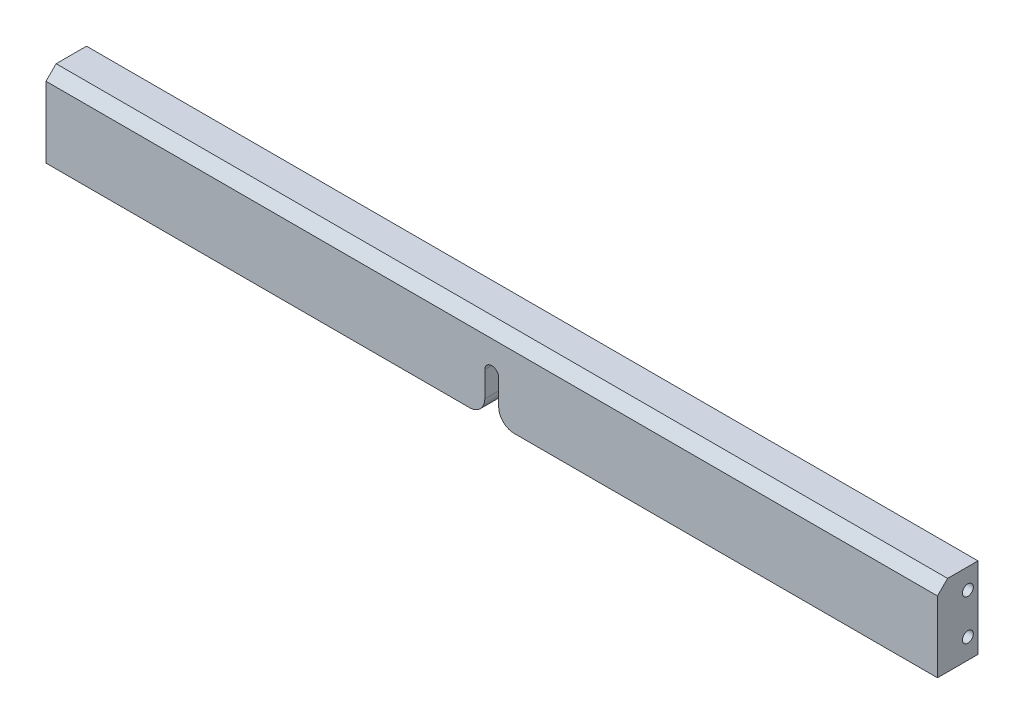
ISO-10303-21;
HEADER;
FILE_DESCRIPTION(('STEP AP214'),'2;1');
FILE_NAME('part.step','',(''),(''),'','','');
FILE_SCHEMA(('AUTOMOTIVE_DESIGN { 1 0 10303 214 1 1 1 1 }'));
ENDSEC;
DATA;
#1=APPLICATION_CONTEXT('core data for automotive mechanical design processes');
#2=APPLICATION_PROTOCOL_DEFINITION('international standard','automotive_design',2000,#1);
#3=PRODUCT_CONTEXT('',#1,'mechanical');
#4=PRODUCT('Part','Part','',(#3));
#5=PRODUCT_RELATED_PRODUCT_CATEGORY('part','',(#4));
#6=PRODUCT_DEFINITION_FORMATION('','',#4);
#7=PRODUCT_DEFINITION_CONTEXT('part definition',#1,'design');
#8=PRODUCT_DEFINITION('design','',#6,#7);
#9=PRODUCT_DEFINITION_SHAPE('','',#8);
#10=(LENGTH_UNIT() NAMED_UNIT(*) SI_UNIT(.MILLI.,.METRE.));
#11=(NAMED_UNIT(*) PLANE_ANGLE_UNIT() SI_UNIT($,.RADIAN.));
#12=(NAMED_UNIT(*) SI_UNIT($,.STERADIAN.) SOLID_ANGLE_UNIT());
#13=UNCERTAINTY_MEASURE_WITH_UNIT(LENGTH_MEASURE(1.E-05),#10,'distance_accuracy_value','');
#14=(GEOMETRIC_REPRESENTATION_CONTEXT(3) GLOBAL_UNCERTAINTY_ASSIGNED_CONTEXT((#13)) GLOBAL_UNIT_ASSIGNED_CONTEXT((#10,
#11,#12)) REPRESENTATION_CONTEXT('',''));
#15=CARTESIAN_POINT('',(0.,0.,0.));
#16=DIRECTION('',(0.,0.,1.));
#17=DIRECTION('',(1.,0.,0.));
#18=AXIS2_PLACEMENT_3D('',#15,#16,#17);
#19=CARTESIAN_POINT('',(-279.4,-25.4,12.7));
#20=DIRECTION('',(0.,1.,0.));
#21=DIRECTION('',(0.,0.,1.));
#22=AXIS2_PLACEMENT_3D('',#19,#20,#21);
#23=PLANE('',#22);
#24=DIRECTION('',(1.,0.,0.));
#25=VECTOR('',#24,1.);
#26=CARTESIAN_POINT('',(-279.4,-25.4,-12.7));
#27=LINE('',#26,#25);
#28=CARTESIAN_POINT('',(-279.4,-25.4,-12.7));
#29=VERTEX_POINT('',#28);
#30=CARTESIAN_POINT('',(-13.890625,-25.4,-12.7));
#31=VERTEX_POINT('',#30);
#32=EDGE_CURVE('E191',#29,#31,#27,.T.);
#33=ORIENTED_EDGE('',*,*,#32,.T.);
#34=DIRECTION('',(0.,0.,-1.));
#35=VECTOR('',#34,1.);
#36=CARTESIAN_POINT('',(-13.890625,-25.4,12.7));
#37=LINE('',#36,#35);
#38=CARTESIAN_POINT('',(-13.890625,-25.4,12.7));
#39=VERTEX_POINT('',#38);
#40=EDGE_CURVE('E233',#31,#39,#37,.F.);
#41=ORIENTED_EDGE('',*,*,#40,.T.);
#42=DIRECTION('',(1.,0.,0.));
#43=VECTOR('',#42,1.);
#44=CARTESIAN_POINT('',(-279.4,-25.4,12.7));
#45=LINE('',#44,#43);
#46=CARTESIAN_POINT('',(-279.4,-25.4,12.7));
#47=VERTEX_POINT('',#46);
#48=EDGE_CURVE('E194',#47,#39,#45,.T.);
#49=ORIENTED_EDGE('',*,*,#48,.F.);
#50=DIRECTION('',(0.,0.,-1.));
#51=VECTOR('',#50,1.);
#52=CARTESIAN_POINT('',(-279.4,-25.4,12.7));
#53=LINE('',#52,#51);
#54=EDGE_CURVE('E210',#47,#29,#53,.T.);
#55=ORIENTED_EDGE('',*,*,#54,.T.);
#56=EDGE_LOOP('',(#33,#41,#49,#55));
#57=FACE_BOUND('',#56,.T.);
#58=ADVANCED_FACE('F42',(#57),#23,.F.);
#59=CARTESIAN_POINT('',(279.4,25.4,12.7));
#60=DIRECTION('',(-1.,0.,0.));
#61=DIRECTION('',(0.,0.,1.));
#62=AXIS2_PLACEMENT_3D('',#59,#60,#61);
#63=PLANE('',#62);
#64=CARTESIAN_POINT('',(279.4,12.7,-6.35));
#65=DIRECTION('',(1.,0.,0.));
#66=DIRECTION('',(0.,0.,-1.));
#67=AXIS2_PLACEMENT_3D('',#64,#65,#66);
#68=CIRCLE('',#67,3.4);
#69=CARTESIAN_POINT('',(279.4,12.7,-9.74999999999999));
#70=VERTEX_POINT('',#69);
#71=EDGE_CURVE('E154',#70,#70,#68,.T.);
#72=ORIENTED_EDGE('',*,*,#71,.F.);
#73=EDGE_LOOP('',(#72));
#74=FACE_BOUND('',#73,.T.);
#75=CARTESIAN_POINT('',(279.4,-12.7,-6.35));
#76=DIRECTION('',(1.,0.,0.));
#77=DIRECTION('',(0.,0.,-1.));
#78=AXIS2_PLACEMENT_3D('',#75,#76,#77);
#79=CIRCLE('',#78,3.4);
#80=CARTESIAN_POINT('',(279.4,-12.7,-9.75));
#81=VERTEX_POINT('',#80);
#82=EDGE_CURVE('E160',#81,#81,#79,.T.);
#83=ORIENTED_EDGE('',*,*,#82,.F.);
#84=EDGE_LOOP('',(#83));
#85=FACE_BOUND('',#84,.T.);
#86=DIRECTION('',(0.,0.,-1.));
#87=VECTOR('',#86,1.);
#88=CARTESIAN_POINT('',(279.4,25.4,12.7));
#89=LINE('',#88,#87);
#90=CARTESIAN_POINT('',(279.4,25.4,6.34999999999998));
#91=VERTEX_POINT('',#90);
#92=CARTESIAN_POINT('',(279.4,25.4,-12.7));
#93=VERTEX_POINT('',#92);
#94=EDGE_CURVE('E215',#91,#93,#89,.T.);
#95=ORIENTED_EDGE('',*,*,#94,.F.);
#96=DIRECTION('',(0.,-0.707106781186544,0.707106781186551));
#97=VECTOR('',#96,1.);
#98=CARTESIAN_POINT('',(279.4,19.05,12.7));
#99=LINE('',#98,#97);
#100=CARTESIAN_POINT('',(279.4,19.05,12.7));
#101=VERTEX_POINT('',#100);
#102=EDGE_CURVE('E12',#91,#101,#99,.T.);
#103=ORIENTED_EDGE('',*,*,#102,.T.);
#104=DIRECTION('',(0.,1.,0.));
#105=VECTOR('',#104,1.);
#106=CARTESIAN_POINT('',(279.4,25.4,12.7));
#107=LINE('',#106,#105);
#108=CARTESIAN_POINT('',(279.4,-25.4,12.7));
#109=VERTEX_POINT('',#108);
#110=EDGE_CURVE('E187',#109,#101,#107,.T.);
#111=ORIENTED_EDGE('',*,*,#110,.F.);
#112=DIRECTION('',(0.,0.,-1.));
#113=VECTOR('',#112,1.);
#114=CARTESIAN_POINT('',(279.4,-25.4,12.7));
#115=LINE('',#114,#113);
#116=CARTESIAN_POINT('',(279.4,-25.4,-12.7));
#117=VERTEX_POINT('',#116);
#118=EDGE_CURVE('E197',#109,#117,#115,.T.);
#119=ORIENTED_EDGE('',*,*,#118,.T.);
#120=DIRECTION('',(0.,1.,0.));
#121=VECTOR('',#120,1.);
#122=CARTESIAN_POINT('',(279.4,25.4,-12.7));
#123=LINE('',#122,#121);
#124=EDGE_CURVE('E186',#117,#93,#123,.T.);
#125=ORIENTED_EDGE('',*,*,#124,.T.);
#126=EDGE_LOOP('',(#95,#103,#111,#119,#125));
#127=FACE_BOUND('',#126,.T.);
#128=ADVANCED_FACE('F284',(#74,#85,#127),#63,.F.);
#129=CARTESIAN_POINT('',(-279.4,25.4,12.7));
#130=DIRECTION('',(0.,-1.,0.));
#131=DIRECTION('',(0.,0.,-1.));
#132=AXIS2_PLACEMENT_3D('',#129,#130,#131);
#133=PLANE('',#132);
#134=DIRECTION('',(0.,0.,-1.));
#135=VECTOR('',#134,1.);
#136=CARTESIAN_POINT('',(-279.4,25.4,12.7));
#137=LINE('',#136,#135);
#138=CARTESIAN_POINT('',(-279.4,25.4,6.34999999999998));
#139=VERTEX_POINT('',#138);
#140=CARTESIAN_POINT('',(-279.4,25.4,-12.7));
#141=VERTEX_POINT('',#140);
#142=EDGE_CURVE('E213',#139,#141,#137,.T.);
#143=ORIENTED_EDGE('',*,*,#142,.F.);
#144=DIRECTION('',(1.,0.,0.));
#145=VECTOR('',#144,1.);
#146=CARTESIAN_POINT('',(279.4,25.4,6.34999999999998));
#147=LINE('',#146,#145);
#148=EDGE_CURVE('E50',#139,#91,#147,.T.);
#149=ORIENTED_EDGE('',*,*,#148,.T.);
#150=ORIENTED_EDGE('',*,*,#94,.T.);
#151=DIRECTION('',(-1.,0.,0.));
#152=VECTOR('',#151,1.);
#153=CARTESIAN_POINT('',(-279.4,25.4,-12.7));
#154=LINE('',#153,#152);
#155=EDGE_CURVE('E200',#93,#141,#154,.T.);
#156=ORIENTED_EDGE('',*,*,#155,.T.);
#157=EDGE_LOOP('',(#143,#149,#150,#156));
#158=FACE_BOUND('',#157,.T.);
#159=ADVANCED_FACE('F295',(#158),#133,.F.);
#160=CARTESIAN_POINT('',(-279.4,25.4,12.7));
#161=DIRECTION('',(1.,0.,0.));
#162=DIRECTION('',(0.,0.,-1.));
#163=AXIS2_PLACEMENT_3D('',#160,#161,#162);
#164=PLANE('',#163);
#165=CARTESIAN_POINT('',(-279.4,12.7,-6.35));
#166=DIRECTION('',(-1.,0.,0.));
#167=DIRECTION('',(0.,0.,1.));
#168=AXIS2_PLACEMENT_3D('',#165,#166,#167);
#169=CIRCLE('',#168,3.39999999999999);
#170=CARTESIAN_POINT('',(-279.4,12.7,-2.95000000000001));
#171=VERTEX_POINT('',#170);
#172=EDGE_CURVE('E144',#171,#171,#169,.T.);
#173=ORIENTED_EDGE('',*,*,#172,.F.);
#174=EDGE_LOOP('',(#173));
#175=FACE_BOUND('',#174,.T.);
#176=CARTESIAN_POINT('',(-279.4,-12.7,-6.35));
#177=DIRECTION('',(-1.,0.,0.));
#178=DIRECTION('',(0.,0.,1.));
#179=AXIS2_PLACEMENT_3D('',#176,#177,#178);
#180=CIRCLE('',#179,3.39999999999999);
#181=CARTESIAN_POINT('',(-279.4,-12.7,-2.95000000000001));
#182=VERTEX_POINT('',#181);
#183=EDGE_CURVE('E143',#182,#182,#180,.T.);
#184=ORIENTED_EDGE('',*,*,#183,.F.);
#185=EDGE_LOOP('',(#184));
#186=FACE_BOUND('',#185,.T.);
#187=DIRECTION('',(0.,-1.,0.));
#188=VECTOR('',#187,1.);
#189=CARTESIAN_POINT('',(-279.4,25.4,12.7));
#190=LINE('',#189,#188);
#191=CARTESIAN_POINT('',(-279.4,19.05,12.7));
#192=VERTEX_POINT('',#191);
#193=EDGE_CURVE('E190',#192,#47,#190,.T.);
#194=ORIENTED_EDGE('',*,*,#193,.F.);
#195=DIRECTION('',(0.,0.707106781186544,-0.707106781186551));
#196=VECTOR('',#195,1.);
#197=CARTESIAN_POINT('',(-279.4,19.05,12.7));
#198=LINE('',#197,#196);
#199=EDGE_CURVE('E64',#192,#139,#198,.T.);
#200=ORIENTED_EDGE('',*,*,#199,.T.);
#201=ORIENTED_EDGE('',*,*,#142,.T.);
#202=DIRECTION('',(0.,-1.,0.));
#203=VECTOR('',#202,1.);
#204=CARTESIAN_POINT('',(-279.4,25.4,-12.7));
#205=LINE('',#204,#203);
#206=EDGE_CURVE('E203',#141,#29,#205,.T.);
#207=ORIENTED_EDGE('',*,*,#206,.T.);
#208=ORIENTED_EDGE('',*,*,#54,.F.);
#209=EDGE_LOOP('',(#194,#200,#201,#207,#208));
#210=FACE_BOUND('',#209,.T.);
#211=ADVANCED_FACE('F245',(#175,#186,#210),#164,.F.);
#212=CARTESIAN_POINT('',(13.890625,-25.4,12.7));
#213=VERTEX_POINT('',#212);
#214=EDGE_CURVE('E193',#213,#109,#45,.T.);
#215=ORIENTED_EDGE('',*,*,#214,.F.);
#216=DIRECTION('',(0.,0.,1.));
#217=VECTOR('',#216,1.);
#218=CARTESIAN_POINT('',(13.890625,-25.4,12.7));
#219=LINE('',#218,#217);
#220=CARTESIAN_POINT('',(13.890625,-25.4,-12.7));
#221=VERTEX_POINT('',#220);
#222=EDGE_CURVE('E224',#213,#221,#219,.F.);
#223=ORIENTED_EDGE('',*,*,#222,.T.);
#224=EDGE_CURVE('E205',#221,#117,#27,.T.);
#225=ORIENTED_EDGE('',*,*,#224,.T.);
#226=ORIENTED_EDGE('',*,*,#118,.F.);
#227=EDGE_LOOP('',(#215,#223,#225,#226));
#228=FACE_BOUND('',#227,.T.);
#229=ADVANCED_FACE('F278',(#228),#23,.F.);
#230=CARTESIAN_POINT('',(279.4,-25.4,12.7));
#231=DIRECTION('',(0.,0.,1.));
#232=DIRECTION('',(1.,0.,0.));
#233=AXIS2_PLACEMENT_3D('',#230,#231,#232);
#234=PLANE('',#233);
#235=ORIENTED_EDGE('',*,*,#110,.T.);
#236=DIRECTION('',(-1.,0.,0.));
#237=VECTOR('',#236,1.);
#238=CARTESIAN_POINT('',(-279.4,19.05,12.7));
#239=LINE('',#238,#237);
#240=EDGE_CURVE('E235',#101,#192,#239,.T.);
#241=ORIENTED_EDGE('',*,*,#240,.T.);
#242=ORIENTED_EDGE('',*,*,#193,.T.);
#243=ORIENTED_EDGE('',*,*,#48,.T.);
#244=CARTESIAN_POINT('',(-13.890625,-15.875,12.7));
#245=DIRECTION('',(0.,0.,1.));
#246=DIRECTION('',(1.,0.,0.));
#247=AXIS2_PLACEMENT_3D('',#244,#245,#246);
#248=CIRCLE('',#247,9.525);
#249=CARTESIAN_POINT('',(-4.365625,-15.875,12.7));
#250=VERTEX_POINT('',#249);
#251=EDGE_CURVE('E220',#39,#250,#248,.T.);
#252=ORIENTED_EDGE('',*,*,#251,.T.);
#253=DIRECTION('',(0.,-1.,0.));
#254=VECTOR('',#253,1.);
#255=CARTESIAN_POINT('',(-4.365625,-25.4,12.7));
#256=LINE('',#255,#254);
#257=CARTESIAN_POINT('',(-4.365625,0.,12.7));
#258=VERTEX_POINT('',#257);
#259=EDGE_CURVE('E175',#258,#250,#256,.T.);
#260=ORIENTED_EDGE('',*,*,#259,.F.);
#261=CARTESIAN_POINT('',(0.,0.,12.7));
#262=DIRECTION('',(0.,0.,1.));
#263=DIRECTION('',(1.,0.,0.));
#264=AXIS2_PLACEMENT_3D('',#261,#262,#263);
#265=CIRCLE('',#264,4.365625);
#266=CARTESIAN_POINT('',(4.365625,0.,12.7));
#267=VERTEX_POINT('',#266);
#268=EDGE_CURVE('E172',#267,#258,#265,.T.);
#269=ORIENTED_EDGE('',*,*,#268,.F.);
#270=DIRECTION('',(0.,1.,0.));
#271=VECTOR('',#270,1.);
#272=CARTESIAN_POINT('',(4.365625,-25.4,12.7));
#273=LINE('',#272,#271);
#274=CARTESIAN_POINT('',(4.365625,-15.875,12.7));
#275=VERTEX_POINT('',#274);
#276=EDGE_CURVE('E170',#275,#267,#273,.T.);
#277=ORIENTED_EDGE('',*,*,#276,.F.);
#278=CARTESIAN_POINT('',(13.890625,-15.875,12.7));
#279=DIRECTION('',(0.,0.,1.));
#280=DIRECTION('',(1.,0.,0.));
#281=AXIS2_PLACEMENT_3D('',#278,#279,#280);
#282=CIRCLE('',#281,9.525);
#283=EDGE_CURVE('E222',#275,#213,#282,.T.);
#284=ORIENTED_EDGE('',*,*,#283,.T.);
#285=ORIENTED_EDGE('',*,*,#214,.T.);
#286=EDGE_LOOP('',(#235,#241,#242,#243,#252,#260,#269,#277,#284,#285));
#287=FACE_BOUND('',#286,.T.);
#288=ADVANCED_FACE('F240',(#287),#234,.T.);
#289=CARTESIAN_POINT('',(279.4,-25.4,-12.7));
#290=DIRECTION('',(0.,0.,1.));
#291=DIRECTION('',(1.,0.,0.));
#292=AXIS2_PLACEMENT_3D('',#289,#290,#291);
#293=PLANE('',#292);
#294=ORIENTED_EDGE('',*,*,#224,.F.);
#295=CARTESIAN_POINT('',(13.890625,-15.875,-12.7));
#296=DIRECTION('',(0.,0.,1.));
#297=DIRECTION('',(1.,0.,0.));
#298=AXIS2_PLACEMENT_3D('',#295,#296,#297);
#299=CIRCLE('',#298,9.525);
#300=CARTESIAN_POINT('',(4.365625,-15.875,-12.7));
#301=VERTEX_POINT('',#300);
#302=EDGE_CURVE('E228',#221,#301,#299,.F.);
#303=ORIENTED_EDGE('',*,*,#302,.T.);
#304=DIRECTION('',(0.,-1.,0.));
#305=VECTOR('',#304,1.);
#306=CARTESIAN_POINT('',(4.365625,-25.4,-12.7));
#307=LINE('',#306,#305);
#308=CARTESIAN_POINT('',(4.36562499999998,0.,-12.7));
#309=VERTEX_POINT('',#308);
#310=EDGE_CURVE('E181',#309,#301,#307,.T.);
#311=ORIENTED_EDGE('',*,*,#310,.F.);
#312=CARTESIAN_POINT('',(0.,0.,-12.7));
#313=DIRECTION('',(0.,0.,1.));
#314=DIRECTION('',(1.,0.,0.));
#315=AXIS2_PLACEMENT_3D('',#312,#313,#314);
#316=CIRCLE('',#315,4.365625);
#317=CARTESIAN_POINT('',(-4.365625,0.,-12.7));
#318=VERTEX_POINT('',#317);
#319=EDGE_CURVE('E166',#318,#309,#316,.F.);
#320=ORIENTED_EDGE('',*,*,#319,.F.);
#321=DIRECTION('',(0.,1.,0.));
#322=VECTOR('',#321,1.);
#323=CARTESIAN_POINT('',(-4.365625,-25.4,-12.7));
#324=LINE('',#323,#322);
#325=CARTESIAN_POINT('',(-4.365625,-15.875,-12.7));
#326=VERTEX_POINT('',#325);
#327=EDGE_CURVE('E168',#326,#318,#324,.T.);
#328=ORIENTED_EDGE('',*,*,#327,.F.);
#329=CARTESIAN_POINT('',(-13.890625,-15.875,-12.7));
#330=DIRECTION('',(0.,0.,1.));
#331=DIRECTION('',(1.,0.,0.));
#332=AXIS2_PLACEMENT_3D('',#329,#330,#331);
#333=CIRCLE('',#332,9.525);
#334=EDGE_CURVE('E226',#326,#31,#333,.F.);
#335=ORIENTED_EDGE('',*,*,#334,.T.);
#336=ORIENTED_EDGE('',*,*,#32,.F.);
#337=ORIENTED_EDGE('',*,*,#206,.F.);
#338=ORIENTED_EDGE('',*,*,#155,.F.);
#339=ORIENTED_EDGE('',*,*,#124,.F.);
#340=EDGE_LOOP('',(#294,#303,#311,#320,#328,#335,#336,#337,#338,#339));
#341=FACE_BOUND('',#340,.T.);
#342=ADVANCED_FACE('F263',(#341),#293,.F.);
#343=CARTESIAN_POINT('',(-4.365625,-25.4,-12.701));
#344=DIRECTION('',(-1.,0.,0.));
#345=DIRECTION('',(0.,0.,1.));
#346=AXIS2_PLACEMENT_3D('',#343,#344,#345);
#347=PLANE('',#346);
#348=ORIENTED_EDGE('',*,*,#259,.T.);
#349=DIRECTION('',(0.,0.,-1.));
#350=VECTOR('',#349,1.);
#351=CARTESIAN_POINT('',(-4.365625,-15.875,-12.701));
#352=LINE('',#351,#350);
#353=EDGE_CURVE('E230',#250,#326,#352,.T.);
#354=ORIENTED_EDGE('',*,*,#353,.T.);
#355=ORIENTED_EDGE('',*,*,#327,.T.);
#356=DIRECTION('',(0.,0.,1.));
#357=VECTOR('',#356,1.);
#358=CARTESIAN_POINT('',(-4.365625,0.,-12.701));
#359=LINE('',#358,#357);
#360=EDGE_CURVE('E179',#318,#258,#359,.T.);
#361=ORIENTED_EDGE('',*,*,#360,.T.);
#362=EDGE_LOOP('',(#348,#354,#355,#361));
#363=FACE_BOUND('',#362,.T.);
#364=ADVANCED_FACE('F258',(#363),#347,.F.);
#365=CARTESIAN_POINT('',(0.,0.,-12.701));
#366=DIRECTION('',(0.,0.,1.));
#367=DIRECTION('',(1.,0.,0.));
#368=AXIS2_PLACEMENT_3D('',#365,#366,#367);
#369=CYLINDRICAL_SURFACE('',#368,4.365625);
#370=ORIENTED_EDGE('',*,*,#319,.T.);
#371=DIRECTION('',(0.,0.,1.));
#372=VECTOR('',#371,1.);
#373=CARTESIAN_POINT('',(4.365625,0.,-12.701));
#374=LINE('',#373,#372);
#375=EDGE_CURVE('E178',#309,#267,#374,.T.);
#376=ORIENTED_EDGE('',*,*,#375,.T.);
#377=ORIENTED_EDGE('',*,*,#268,.T.);
#378=ORIENTED_EDGE('',*,*,#360,.F.);
#379=EDGE_LOOP('',(#370,#376,#377,#378));
#380=FACE_BOUND('',#379,.T.);
#381=ADVANCED_FACE('F267',(#380),#369,.F.);
#382=CARTESIAN_POINT('',(4.365625,-25.4,-12.701));
#383=DIRECTION('',(1.,0.,0.));
#384=DIRECTION('',(0.,0.,-1.));
#385=AXIS2_PLACEMENT_3D('',#382,#383,#384);
#386=PLANE('',#385);
#387=ORIENTED_EDGE('',*,*,#310,.T.);
#388=DIRECTION('',(0.,0.,1.));
#389=VECTOR('',#388,1.);
#390=CARTESIAN_POINT('',(4.365625,-15.875,-12.701));
#391=LINE('',#390,#389);
#392=EDGE_CURVE('E217',#301,#275,#391,.T.);
#393=ORIENTED_EDGE('',*,*,#392,.T.);
#394=ORIENTED_EDGE('',*,*,#276,.T.);
#395=ORIENTED_EDGE('',*,*,#375,.F.);
#396=EDGE_LOOP('',(#387,#393,#394,#395));
#397=FACE_BOUND('',#396,.T.);
#398=ADVANCED_FACE('F270',(#397),#386,.F.);
#399=CARTESIAN_POINT('',(13.890625,-15.875,-12.701));
#400=DIRECTION('',(0.,0.,1.));
#401=DIRECTION('',(1.,0.,0.));
#402=AXIS2_PLACEMENT_3D('',#399,#400,#401);
#403=CYLINDRICAL_SURFACE('',#402,9.525);
#404=ORIENTED_EDGE('',*,*,#302,.F.);
#405=ORIENTED_EDGE('',*,*,#222,.F.);
#406=ORIENTED_EDGE('',*,*,#283,.F.);
#407=ORIENTED_EDGE('',*,*,#392,.F.);
#408=EDGE_LOOP('',(#404,#405,#406,#407));
#409=FACE_BOUND('',#408,.T.);
#410=ADVANCED_FACE('F280',(#409),#403,.T.);
#411=CARTESIAN_POINT('',(-13.890625,-15.875,-12.701));
#412=DIRECTION('',(0.,0.,-1.));
#413=DIRECTION('',(-1.,0.,0.));
#414=AXIS2_PLACEMENT_3D('',#411,#412,#413);
#415=CYLINDRICAL_SURFACE('',#414,9.525);
#416=ORIENTED_EDGE('',*,*,#251,.F.);
#417=ORIENTED_EDGE('',*,*,#40,.F.);
#418=ORIENTED_EDGE('',*,*,#334,.F.);
#419=ORIENTED_EDGE('',*,*,#353,.F.);
#420=EDGE_LOOP('',(#416,#417,#418,#419));
#421=FACE_BOUND('',#420,.T.);
#422=ADVANCED_FACE('F255',(#421),#415,.T.);
#423=CARTESIAN_POINT('',(259.588,-12.7,-6.35));
#424=DIRECTION('',(1.,0.,0.));
#425=DIRECTION('',(0.,0.,-1.));
#426=AXIS2_PLACEMENT_3D('',#423,#424,#425);
#427=CONICAL_SURFACE('',#426,3.39999999999999,1.02974425867665);
#428=CARTESIAN_POINT('',(257.545073895306,-12.7,-6.35));
#429=VERTEX_POINT('',#428);
#430=VERTEX_LOOP('',#429);
#431=FACE_BOUND('',#430,.T.);
#432=CARTESIAN_POINT('',(259.588,-12.7,-6.35));
#433=DIRECTION('',(1.,0.,0.));
#434=DIRECTION('',(0.,0.,-1.));
#435=AXIS2_PLACEMENT_3D('',#432,#433,#434);
#436=CIRCLE('',#435,3.39999999999999);
#437=CARTESIAN_POINT('',(259.588,-12.7,-9.74999999999999));
#438=VERTEX_POINT('',#437);
#439=EDGE_CURVE('E163',#438,#438,#436,.T.);
#440=ORIENTED_EDGE('',*,*,#439,.T.);
#441=EDGE_LOOP('',(#440));
#442=FACE_BOUND('',#441,.T.);
#443=ADVANCED_FACE('F316',(#431,#442),#427,.F.);
#444=CARTESIAN_POINT('',(279.4,-12.7,-6.35));
#445=DIRECTION('',(1.,0.,0.));
#446=DIRECTION('',(0.,0.,-1.));
#447=AXIS2_PLACEMENT_3D('',#444,#445,#446);
#448=CYLINDRICAL_SURFACE('',#447,3.4);
#449=ORIENTED_EDGE('',*,*,#439,.F.);
#450=EDGE_LOOP('',(#449));
#451=FACE_BOUND('',#450,.T.);
#452=ORIENTED_EDGE('',*,*,#82,.T.);
#453=EDGE_LOOP('',(#452));
#454=FACE_BOUND('',#453,.T.);
#455=ADVANCED_FACE('F320',(#451,#454),#448,.F.);
#456=CARTESIAN_POINT('',(259.588,12.7,-6.35));
#457=DIRECTION('',(1.,0.,0.));
#458=DIRECTION('',(0.,0.,-1.));
#459=AXIS2_PLACEMENT_3D('',#456,#457,#458);
#460=CONICAL_SURFACE('',#459,3.39999999999999,1.02974425867665);
#461=CARTESIAN_POINT('',(257.545073895306,12.7,-6.35));
#462=VERTEX_POINT('',#461);
#463=VERTEX_LOOP('',#462);
#464=FACE_BOUND('',#463,.T.);
#465=CARTESIAN_POINT('',(259.588,12.7,-6.35));
#466=DIRECTION('',(1.,0.,0.));
#467=DIRECTION('',(0.,0.,-1.));
#468=AXIS2_PLACEMENT_3D('',#465,#466,#467);
#469=CIRCLE('',#468,3.39999999999999);
#470=CARTESIAN_POINT('',(259.588,12.7,-9.74999999999999));
#471=VERTEX_POINT('',#470);
#472=EDGE_CURVE('E157',#471,#471,#469,.T.);
#473=ORIENTED_EDGE('',*,*,#472,.T.);
#474=EDGE_LOOP('',(#473));
#475=FACE_BOUND('',#474,.T.);
#476=ADVANCED_FACE('F326',(#464,#475),#460,.F.);
#477=CARTESIAN_POINT('',(279.4,12.7,-6.35));
#478=DIRECTION('',(1.,0.,0.));
#479=DIRECTION('',(0.,0.,-1.));
#480=AXIS2_PLACEMENT_3D('',#477,#478,#479);
#481=CYLINDRICAL_SURFACE('',#480,3.4);
#482=ORIENTED_EDGE('',*,*,#472,.F.);
#483=EDGE_LOOP('',(#482));
#484=FACE_BOUND('',#483,.T.);
#485=ORIENTED_EDGE('',*,*,#71,.T.);
#486=EDGE_LOOP('',(#485));
#487=FACE_BOUND('',#486,.T.);
#488=ADVANCED_FACE('F384',(#484,#487),#481,.F.);
#489=CARTESIAN_POINT('',(-259.588,-12.7,-6.35));
#490=DIRECTION('',(-1.,0.,0.));
#491=DIRECTION('',(0.,0.,1.));
#492=AXIS2_PLACEMENT_3D('',#489,#490,#491);
#493=CONICAL_SURFACE('',#492,3.39999999999999,1.02974425867665);
#494=CARTESIAN_POINT('',(-257.545073895306,-12.7,-6.35));
#495=VERTEX_POINT('',#494);
#496=VERTEX_LOOP('',#495);
#497=FACE_BOUND('',#496,.T.);
#498=CARTESIAN_POINT('',(-259.588,-12.7,-6.35));
#499=DIRECTION('',(-1.,0.,0.));
#500=DIRECTION('',(0.,0.,1.));
#501=AXIS2_PLACEMENT_3D('',#498,#499,#500);
#502=CIRCLE('',#501,3.39999999999999);
#503=CARTESIAN_POINT('',(-259.588,-12.7,-2.95000000000002));
#504=VERTEX_POINT('',#503);
#505=EDGE_CURVE('E147',#504,#504,#502,.T.);
#506=ORIENTED_EDGE('',*,*,#505,.T.);
#507=EDGE_LOOP('',(#506));
#508=FACE_BOUND('',#507,.T.);
#509=ADVANCED_FACE('F393',(#497,#508),#493,.F.);
#510=CARTESIAN_POINT('',(-279.4,-12.7,-6.35));
#511=DIRECTION('',(-1.,0.,0.));
#512=DIRECTION('',(0.,0.,1.));
#513=AXIS2_PLACEMENT_3D('',#510,#511,#512);
#514=CYLINDRICAL_SURFACE('',#513,3.39999999999999);
#515=ORIENTED_EDGE('',*,*,#505,.F.);
#516=EDGE_LOOP('',(#515));
#517=FACE_BOUND('',#516,.T.);
#518=ORIENTED_EDGE('',*,*,#183,.T.);
#519=EDGE_LOOP('',(#518));
#520=FACE_BOUND('',#519,.T.);
#521=ADVANCED_FACE('F137',(#517,#520),#514,.F.);
#522=CARTESIAN_POINT('',(-259.588,12.7,-6.35));
#523=DIRECTION('',(-1.,0.,0.));
#524=DIRECTION('',(0.,0.,1.));
#525=AXIS2_PLACEMENT_3D('',#522,#523,#524);
#526=CONICAL_SURFACE('',#525,3.39999999999999,1.02974425867665);
#527=CARTESIAN_POINT('',(-257.545073895306,12.7,-6.35));
#528=VERTEX_POINT('',#527);
#529=VERTEX_LOOP('',#528);
#530=FACE_BOUND('',#529,.T.);
#531=CARTESIAN_POINT('',(-259.588,12.7,-6.35));
#532=DIRECTION('',(-1.,0.,0.));
#533=DIRECTION('',(0.,0.,1.));
#534=AXIS2_PLACEMENT_3D('',#531,#532,#533);
#535=CIRCLE('',#534,3.39999999999999);
#536=CARTESIAN_POINT('',(-259.588,12.7,-2.95000000000001));
#537=VERTEX_POINT('',#536);
#538=EDGE_CURVE('E141',#537,#537,#535,.T.);
#539=ORIENTED_EDGE('',*,*,#538,.T.);
#540=EDGE_LOOP('',(#539));
#541=FACE_BOUND('',#540,.T.);
#542=ADVANCED_FACE('F133',(#530,#541),#526,.F.);
#543=CARTESIAN_POINT('',(-279.4,12.7,-6.35));
#544=DIRECTION('',(-1.,0.,0.));
#545=DIRECTION('',(0.,0.,1.));
#546=AXIS2_PLACEMENT_3D('',#543,#544,#545);
#547=CYLINDRICAL_SURFACE('',#546,3.39999999999999);
#548=ORIENTED_EDGE('',*,*,#538,.F.);
#549=EDGE_LOOP('',(#548));
#550=FACE_BOUND('',#549,.T.);
#551=ORIENTED_EDGE('',*,*,#172,.T.);
#552=EDGE_LOOP('',(#551));
#553=FACE_BOUND('',#552,.T.);
#554=ADVANCED_FACE('F136',(#550,#553),#547,.F.);
#555=CARTESIAN_POINT('',(279.4,19.05,12.7));
#556=DIRECTION('',(0.,0.707106781186551,0.707106781186544));
#557=DIRECTION('',(1.,0.,0.));
#558=AXIS2_PLACEMENT_3D('',#555,#556,#557);
#559=PLANE('',#558);
#560=ORIENTED_EDGE('',*,*,#102,.F.);
#561=ORIENTED_EDGE('',*,*,#148,.F.);
#562=ORIENTED_EDGE('',*,*,#199,.F.);
#563=ORIENTED_EDGE('',*,*,#240,.F.);
#564=EDGE_LOOP('',(#560,#561,#562,#563));
#565=FACE_BOUND('',#564,.T.);
#566=ADVANCED_FACE('F44',(#565),#559,.T.);
#567=CLOSED_SHELL('',(#58,#128,#159,#211,#229,#288,#342,#364,#381,#398,#410,#422,#443,#455,#476,
#488,#509,#521,#542,#554,#566));
#568=MANIFOLD_SOLID_BREP('B2',#567);
#569=ADVANCED_BREP_SHAPE_REPRESENTATION('',(#18,#568),#14);
#570=SHAPE_DEFINITION_REPRESENTATION(#9,#569);
ENDSEC;
END-ISO-10303-21;
